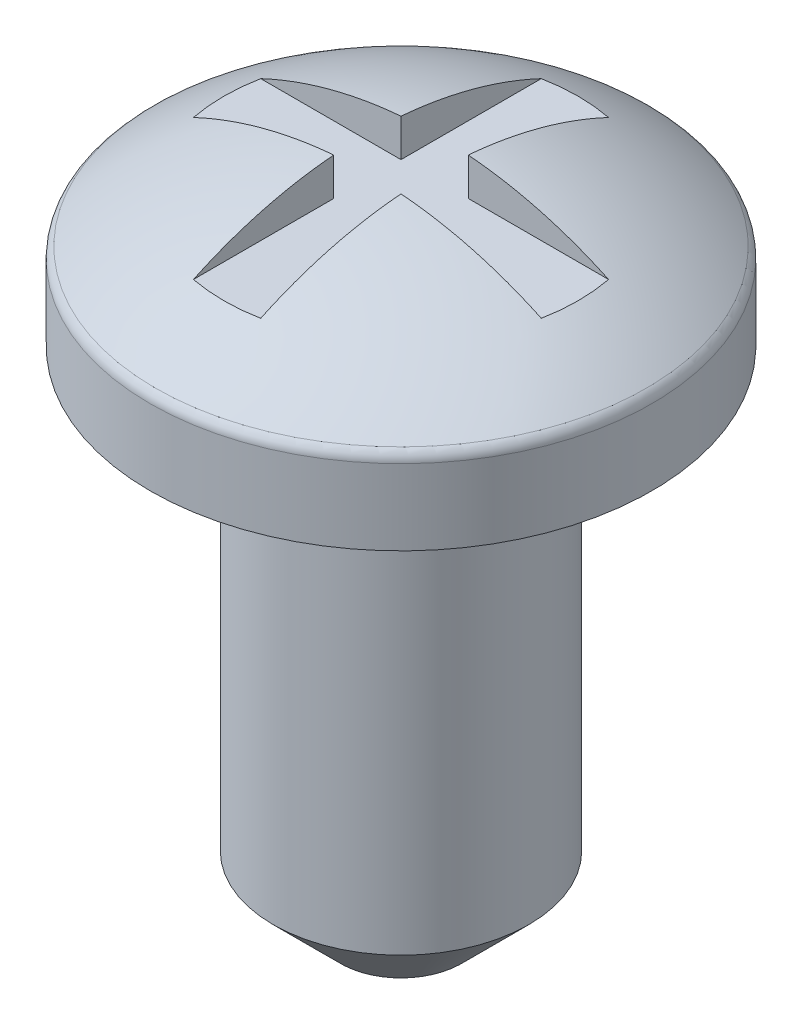
ISO-10303-21;
HEADER;
FILE_DESCRIPTION(('STEP AP214'),'2;1');
FILE_NAME('part.step','',(''),(''),'','','');
FILE_SCHEMA(('AUTOMOTIVE_DESIGN { 1 0 10303 214 1 1 1 1 }'));
ENDSEC;
DATA;
#1=APPLICATION_CONTEXT('core data for automotive mechanical design processes');
#2=APPLICATION_PROTOCOL_DEFINITION('international standard','automotive_design',2000,#1);
#3=PRODUCT_CONTEXT('',#1,'mechanical');
#4=PRODUCT('Part','Part','',(#3));
#5=PRODUCT_RELATED_PRODUCT_CATEGORY('part','',(#4));
#6=PRODUCT_DEFINITION_FORMATION('','',#4);
#7=PRODUCT_DEFINITION_CONTEXT('part definition',#1,'design');
#8=PRODUCT_DEFINITION('design','',#6,#7);
#9=PRODUCT_DEFINITION_SHAPE('','',#8);
#10=(LENGTH_UNIT() NAMED_UNIT(*) SI_UNIT(.MILLI.,.METRE.));
#11=(NAMED_UNIT(*) PLANE_ANGLE_UNIT() SI_UNIT($,.RADIAN.));
#12=(NAMED_UNIT(*) SI_UNIT($,.STERADIAN.) SOLID_ANGLE_UNIT());
#13=UNCERTAINTY_MEASURE_WITH_UNIT(LENGTH_MEASURE(1.E-05),#10,'distance_accuracy_value','');
#14=(GEOMETRIC_REPRESENTATION_CONTEXT(3) GLOBAL_UNCERTAINTY_ASSIGNED_CONTEXT((#13)) GLOBAL_UNIT_ASSIGNED_CONTEXT((#10,
#11,#12)) REPRESENTATION_CONTEXT('',''));
#15=CARTESIAN_POINT('',(0.,0.,0.));
#16=DIRECTION('',(0.,0.,1.));
#17=DIRECTION('',(1.,0.,0.));
#18=AXIS2_PLACEMENT_3D('',#15,#16,#17);
#19=CARTESIAN_POINT('',(0.,4.9784,0.));
#20=DIRECTION('',(0.,-1.,0.));
#21=DIRECTION('',(1.,0.,0.));
#22=AXIS2_PLACEMENT_3D('',#19,#20,#21);
#23=SPHERICAL_SURFACE('',#22,7.7216);
#24=CARTESIAN_POINT('',(0.,11.1537093314093,0.));
#25=DIRECTION('',(0.,-1.,0.));
#26=DIRECTION('',(0.,0.,-1.));
#27=AXIS2_PLACEMENT_3D('',#24,#25,#26);
#28=CIRCLE('',#27,4.63558639455782);
#29=CARTESIAN_POINT('',(0.,11.1537093314093,-4.63558639455782));
#30=VERTEX_POINT('',#29);
#31=EDGE_CURVE('E11',#30,#30,#28,.F.);
#32=ORIENTED_EDGE('',*,*,#31,.T.);
#33=EDGE_LOOP('',(#32));
#34=FACE_BOUND('',#33,.T.);
#35=CARTESIAN_POINT('',(0.,4.9784,0.635));
#36=DIRECTION('',(0.,0.,1.));
#37=DIRECTION('',(1.,0.,0.));
#38=AXIS2_PLACEMENT_3D('',#35,#36,#37);
#39=CIRCLE('',#38,7.69544550757135);
#40=CARTESIAN_POINT('',(0.634999999999998,12.6476018202679,0.635));
#41=VERTEX_POINT('',#40);
#42=CARTESIAN_POINT('',(3.28387719015191,11.938,0.635));
#43=VERTEX_POINT('',#42);
#44=EDGE_CURVE('E162',#41,#43,#39,.F.);
#45=ORIENTED_EDGE('',*,*,#44,.F.);
#46=CARTESIAN_POINT('',(0.635,4.9784,0.));
#47=DIRECTION('',(-1.,0.,0.));
#48=DIRECTION('',(0.,0.,1.));
#49=AXIS2_PLACEMENT_3D('',#46,#47,#48);
#50=CIRCLE('',#49,7.69544550757135);
#51=CARTESIAN_POINT('',(0.634999999999989,11.938,3.28387719015192));
#52=VERTEX_POINT('',#51);
#53=EDGE_CURVE('E47',#41,#52,#50,.F.);
#54=ORIENTED_EDGE('',*,*,#53,.T.);
#55=CARTESIAN_POINT('',(0.,11.938,0.));
#56=DIRECTION('',(0.,-1.,0.));
#57=DIRECTION('',(1.,0.,0.));
#58=AXIS2_PLACEMENT_3D('',#55,#56,#57);
#59=CIRCLE('',#58,3.34470841778473);
#60=CARTESIAN_POINT('',(-0.635000000000012,11.938,3.28387719015191));
#61=VERTEX_POINT('',#60);
#62=EDGE_CURVE('E104',#61,#52,#59,.F.);
#63=ORIENTED_EDGE('',*,*,#62,.F.);
#64=CARTESIAN_POINT('',(-0.635,4.9784,0.));
#65=DIRECTION('',(-1.,0.,0.));
#66=DIRECTION('',(0.,0.,1.));
#67=AXIS2_PLACEMENT_3D('',#64,#65,#66);
#68=CIRCLE('',#67,7.69544550757135);
#69=CARTESIAN_POINT('',(-0.635000000000002,12.6476018202679,0.634999999999996));
#70=VERTEX_POINT('',#69);
#71=EDGE_CURVE('E142',#70,#61,#68,.F.);
#72=ORIENTED_EDGE('',*,*,#71,.F.);
#73=CARTESIAN_POINT('',(0.,4.9784,0.635));
#74=DIRECTION('',(0.,0.,-1.));
#75=DIRECTION('',(-1.,0.,0.));
#76=AXIS2_PLACEMENT_3D('',#73,#74,#75);
#77=CIRCLE('',#76,7.69544550757135);
#78=CARTESIAN_POINT('',(-3.28387719015192,11.938,0.634999999999977));
#79=VERTEX_POINT('',#78);
#80=EDGE_CURVE('E133',#70,#79,#77,.F.);
#81=ORIENTED_EDGE('',*,*,#80,.T.);
#82=CARTESIAN_POINT('',(0.,11.938,0.));
#83=DIRECTION('',(0.,-1.,0.));
#84=DIRECTION('',(0.,0.,1.));
#85=AXIS2_PLACEMENT_3D('',#82,#83,#84);
#86=CIRCLE('',#85,3.34470841778473);
#87=CARTESIAN_POINT('',(-3.28387719015191,11.938,-0.635000000000023));
#88=VERTEX_POINT('',#87);
#89=EDGE_CURVE('E136',#88,#79,#86,.F.);
#90=ORIENTED_EDGE('',*,*,#89,.F.);
#91=CARTESIAN_POINT('',(0.,4.9784,-0.635));
#92=DIRECTION('',(0.,0.,-1.));
#93=DIRECTION('',(-1.,0.,0.));
#94=AXIS2_PLACEMENT_3D('',#91,#92,#93);
#95=CIRCLE('',#94,7.69544550757135);
#96=CARTESIAN_POINT('',(-0.634999999999993,12.6476018202679,-0.635000000000004));
#97=VERTEX_POINT('',#96);
#98=EDGE_CURVE('E121',#97,#88,#95,.F.);
#99=ORIENTED_EDGE('',*,*,#98,.F.);
#100=CARTESIAN_POINT('',(-0.635,4.9784,0.));
#101=DIRECTION('',(1.,0.,0.));
#102=DIRECTION('',(0.,0.,-1.));
#103=AXIS2_PLACEMENT_3D('',#100,#101,#102);
#104=CIRCLE('',#103,7.69544550757135);
#105=CARTESIAN_POINT('',(-0.634999999999966,11.938,-3.28387719015192));
#106=VERTEX_POINT('',#105);
#107=EDGE_CURVE('E120',#97,#106,#104,.F.);
#108=ORIENTED_EDGE('',*,*,#107,.T.);
#109=CARTESIAN_POINT('',(0.,11.938,0.));
#110=DIRECTION('',(0.,-1.,0.));
#111=DIRECTION('',(-1.,0.,0.));
#112=AXIS2_PLACEMENT_3D('',#109,#110,#111);
#113=CIRCLE('',#112,3.34470841778473);
#114=CARTESIAN_POINT('',(0.635000000000034,11.938,-3.28387719015191));
#115=VERTEX_POINT('',#114);
#116=EDGE_CURVE('E111',#115,#106,#113,.F.);
#117=ORIENTED_EDGE('',*,*,#116,.F.);
#118=CARTESIAN_POINT('',(0.635000000000002,12.6476018202679,-0.635));
#119=VERTEX_POINT('',#118);
#120=EDGE_CURVE('E97',#115,#119,#50,.F.);
#121=ORIENTED_EDGE('',*,*,#120,.T.);
#122=CARTESIAN_POINT('',(0.,4.9784,-0.635));
#123=DIRECTION('',(0.,0.,1.));
#124=DIRECTION('',(1.,0.,0.));
#125=AXIS2_PLACEMENT_3D('',#122,#123,#124);
#126=CIRCLE('',#125,7.69544550757135);
#127=CARTESIAN_POINT('',(3.28387719015191,11.938,-0.635));
#128=VERTEX_POINT('',#127);
#129=EDGE_CURVE('E55',#119,#128,#126,.F.);
#130=ORIENTED_EDGE('',*,*,#129,.T.);
#131=CARTESIAN_POINT('',(0.,11.938,0.));
#132=DIRECTION('',(0.,-1.,0.));
#133=DIRECTION('',(0.,0.,-1.));
#134=AXIS2_PLACEMENT_3D('',#131,#132,#133);
#135=CIRCLE('',#134,3.34470841778473);
#136=EDGE_CURVE('E165',#43,#128,#135,.F.);
#137=ORIENTED_EDGE('',*,*,#136,.F.);
#138=EDGE_LOOP('',(#45,#54,#63,#72,#81,#90,#99,#108,#117,#121,#130,#137));
#139=FACE_BOUND('',#138,.T.);
#140=ADVANCED_FACE('F32',(#34,#139),#23,.T.);
#141=CARTESIAN_POINT('',(0.,4.9784,-0.635));
#142=DIRECTION('',(0.,0.,1.));
#143=DIRECTION('',(1.,0.,0.));
#144=AXIS2_PLACEMENT_3D('',#141,#142,#143);
#145=PLANE('',#144);
#146=ORIENTED_EDGE('',*,*,#129,.F.);
#147=DIRECTION('',(0.,-1.,0.));
#148=VECTOR('',#147,1.);
#149=CARTESIAN_POINT('',(0.635000000000002,4.9784,-0.635));
#150=LINE('',#149,#148);
#151=CARTESIAN_POINT('',(0.635000000000002,11.938,-0.635));
#152=VERTEX_POINT('',#151);
#153=EDGE_CURVE('E102',#119,#152,#150,.T.);
#154=ORIENTED_EDGE('',*,*,#153,.T.);
#155=DIRECTION('',(1.,0.,0.));
#156=VECTOR('',#155,1.);
#157=CARTESIAN_POINT('',(0.,11.938,-0.635));
#158=LINE('',#157,#156);
#159=EDGE_CURVE('E114',#152,#128,#158,.T.);
#160=ORIENTED_EDGE('',*,*,#159,.T.);
#161=EDGE_LOOP('',(#146,#154,#160));
#162=FACE_BOUND('',#161,.T.);
#163=ADVANCED_FACE('F191',(#162),#145,.T.);
#164=CARTESIAN_POINT('',(0.,4.9784,0.635));
#165=DIRECTION('',(0.,0.,1.));
#166=DIRECTION('',(1.,0.,0.));
#167=AXIS2_PLACEMENT_3D('',#164,#165,#166);
#168=PLANE('',#167);
#169=DIRECTION('',(0.,-1.,0.));
#170=VECTOR('',#169,1.);
#171=CARTESIAN_POINT('',(0.634999999999998,4.9784,0.635));
#172=LINE('',#171,#170);
#173=CARTESIAN_POINT('',(0.634999999999998,11.938,0.635));
#174=VERTEX_POINT('',#173);
#175=EDGE_CURVE('E168',#41,#174,#172,.T.);
#176=ORIENTED_EDGE('',*,*,#175,.F.);
#177=ORIENTED_EDGE('',*,*,#44,.T.);
#178=DIRECTION('',(1.,0.,0.));
#179=VECTOR('',#178,1.);
#180=CARTESIAN_POINT('',(0.,11.938,0.635));
#181=LINE('',#180,#179);
#182=EDGE_CURVE('E153',#174,#43,#181,.T.);
#183=ORIENTED_EDGE('',*,*,#182,.F.);
#184=EDGE_LOOP('',(#176,#177,#183));
#185=FACE_BOUND('',#184,.T.);
#186=ADVANCED_FACE('F197',(#185),#168,.F.);
#187=CARTESIAN_POINT('',(0.,0.,0.));
#188=DIRECTION('',(0.,-1.,0.));
#189=DIRECTION('',(0.,0.,-1.));
#190=AXIS2_PLACEMENT_3D('',#187,#188,#189);
#191=CYLINDRICAL_SURFACE('',#190,4.7371);
#192=CARTESIAN_POINT('',(0.,10.950574156034,0.));
#193=DIRECTION('',(0.,-1.,0.));
#194=DIRECTION('',(0.,0.,-1.));
#195=AXIS2_PLACEMENT_3D('',#192,#193,#194);
#196=CIRCLE('',#195,4.7371);
#197=CARTESIAN_POINT('',(0.,10.950574156034,-4.7371));
#198=VERTEX_POINT('',#197);
#199=EDGE_CURVE('E40',#198,#198,#196,.T.);
#200=ORIENTED_EDGE('',*,*,#199,.T.);
#201=EDGE_LOOP('',(#200));
#202=FACE_BOUND('',#201,.T.);
#203=CARTESIAN_POINT('',(0.,9.525,0.));
#204=DIRECTION('',(0.,-1.,0.));
#205=DIRECTION('',(0.,0.,-1.));
#206=AXIS2_PLACEMENT_3D('',#203,#204,#205);
#207=CIRCLE('',#206,4.7371);
#208=CARTESIAN_POINT('',(0.,9.525,-4.7371));
#209=VERTEX_POINT('',#208);
#210=EDGE_CURVE('E159',#209,#209,#207,.T.);
#211=ORIENTED_EDGE('',*,*,#210,.F.);
#212=EDGE_LOOP('',(#211));
#213=FACE_BOUND('',#212,.T.);
#214=ADVANCED_FACE('F178',(#202,#213),#191,.T.);
#215=CARTESIAN_POINT('',(2.413,9.525,0.));
#216=DIRECTION('',(0.,-1.,0.));
#217=DIRECTION('',(0.,0.,-1.));
#218=AXIS2_PLACEMENT_3D('',#215,#216,#217);
#219=PLANE('',#218);
#220=ORIENTED_EDGE('',*,*,#210,.T.);
#221=EDGE_LOOP('',(#220));
#222=FACE_BOUND('',#221,.T.);
#223=CARTESIAN_POINT('',(0.,9.525,0.));
#224=DIRECTION('',(0.,-1.,0.));
#225=DIRECTION('',(0.,0.,-1.));
#226=AXIS2_PLACEMENT_3D('',#223,#224,#225);
#227=CIRCLE('',#226,2.413);
#228=CARTESIAN_POINT('',(0.,9.525,-2.413));
#229=VERTEX_POINT('',#228);
#230=EDGE_CURVE('E155',#229,#229,#227,.T.);
#231=ORIENTED_EDGE('',*,*,#230,.F.);
#232=EDGE_LOOP('',(#231));
#233=FACE_BOUND('',#232,.T.);
#234=ADVANCED_FACE('F203',(#222,#233),#219,.T.);
#235=CARTESIAN_POINT('',(0.,0.,0.));
#236=DIRECTION('',(0.,-1.,0.));
#237=DIRECTION('',(0.,0.,-1.));
#238=AXIS2_PLACEMENT_3D('',#235,#236,#237);
#239=CYLINDRICAL_SURFACE('',#238,2.413);
#240=CARTESIAN_POINT('',(0.,1.27,0.));
#241=DIRECTION('',(0.,-1.,0.));
#242=DIRECTION('',(0.,0.,-1.));
#243=AXIS2_PLACEMENT_3D('',#240,#241,#242);
#244=CIRCLE('',#243,2.413);
#245=CARTESIAN_POINT('',(0.,1.27,-2.413));
#246=VERTEX_POINT('',#245);
#247=EDGE_CURVE('E173',#246,#246,#244,.F.);
#248=ORIENTED_EDGE('',*,*,#247,.T.);
#249=EDGE_LOOP('',(#248));
#250=FACE_BOUND('',#249,.T.);
#251=ORIENTED_EDGE('',*,*,#230,.T.);
#252=EDGE_LOOP('',(#251));
#253=FACE_BOUND('',#252,.T.);
#254=ADVANCED_FACE('F206',(#250,#253),#239,.T.);
#255=CARTESIAN_POINT('',(0.,0.,0.));
#256=DIRECTION('',(0.,-1.,0.));
#257=DIRECTION('',(0.,0.,-1.));
#258=AXIS2_PLACEMENT_3D('',#255,#256,#257);
#259=PLANE('',#258);
#260=CARTESIAN_POINT('',(0.,0.,0.));
#261=DIRECTION('',(0.,-1.,0.));
#262=DIRECTION('',(0.,0.,-1.));
#263=AXIS2_PLACEMENT_3D('',#260,#261,#262);
#264=CIRCLE('',#263,1.143);
#265=CARTESIAN_POINT('',(0.,0.,-1.143));
#266=VERTEX_POINT('',#265);
#267=EDGE_CURVE('E170',#266,#266,#264,.T.);
#268=ORIENTED_EDGE('',*,*,#267,.T.);
#269=EDGE_LOOP('',(#268));
#270=FACE_BOUND('',#269,.T.);
#271=ADVANCED_FACE('F210',(#270),#259,.T.);
#272=CARTESIAN_POINT('',(0.,11.938,-0.635));
#273=DIRECTION('',(0.,-1.,0.));
#274=DIRECTION('',(0.,0.,-1.));
#275=AXIS2_PLACEMENT_3D('',#272,#273,#274);
#276=PLANE('',#275);
#277=DIRECTION('',(0.,0.,1.));
#278=VECTOR('',#277,1.);
#279=CARTESIAN_POINT('',(0.635,11.938,0.));
#280=LINE('',#279,#278);
#281=EDGE_CURVE('E115',#174,#52,#280,.T.);
#282=ORIENTED_EDGE('',*,*,#281,.F.);
#283=ORIENTED_EDGE('',*,*,#182,.T.);
#284=ORIENTED_EDGE('',*,*,#136,.T.);
#285=ORIENTED_EDGE('',*,*,#159,.F.);
#286=EDGE_CURVE('E100',#115,#152,#280,.T.);
#287=ORIENTED_EDGE('',*,*,#286,.F.);
#288=ORIENTED_EDGE('',*,*,#116,.T.);
#289=DIRECTION('',(0.,0.,-1.));
#290=VECTOR('',#289,1.);
#291=CARTESIAN_POINT('',(-0.635,11.938,0.));
#292=LINE('',#291,#290);
#293=CARTESIAN_POINT('',(-0.634999999999993,11.938,-0.635000000000004));
#294=VERTEX_POINT('',#293);
#295=EDGE_CURVE('E126',#294,#106,#292,.T.);
#296=ORIENTED_EDGE('',*,*,#295,.F.);
#297=DIRECTION('',(-1.,0.,0.));
#298=VECTOR('',#297,1.);
#299=CARTESIAN_POINT('',(0.,11.938,-0.635));
#300=LINE('',#299,#298);
#301=EDGE_CURVE('E124',#294,#88,#300,.T.);
#302=ORIENTED_EDGE('',*,*,#301,.T.);
#303=ORIENTED_EDGE('',*,*,#89,.T.);
#304=DIRECTION('',(-1.,0.,0.));
#305=VECTOR('',#304,1.);
#306=CARTESIAN_POINT('',(0.,11.938,0.635));
#307=LINE('',#306,#305);
#308=CARTESIAN_POINT('',(-0.635000000000002,11.938,0.634999999999996));
#309=VERTEX_POINT('',#308);
#310=EDGE_CURVE('E131',#309,#79,#307,.T.);
#311=ORIENTED_EDGE('',*,*,#310,.F.);
#312=DIRECTION('',(0.,0.,1.));
#313=VECTOR('',#312,1.);
#314=CARTESIAN_POINT('',(-0.635,11.938,0.));
#315=LINE('',#314,#313);
#316=EDGE_CURVE('E145',#309,#61,#315,.T.);
#317=ORIENTED_EDGE('',*,*,#316,.T.);
#318=ORIENTED_EDGE('',*,*,#62,.T.);
#319=EDGE_LOOP('',(#282,#283,#284,#285,#287,#288,#296,#302,#303,#311,#317,#318));
#320=FACE_BOUND('',#319,.T.);
#321=ADVANCED_FACE('F110',(#320),#276,.F.);
#322=CARTESIAN_POINT('',(0.635,4.9784,0.));
#323=DIRECTION('',(-1.,0.,0.));
#324=DIRECTION('',(0.,0.,1.));
#325=AXIS2_PLACEMENT_3D('',#322,#323,#324);
#326=PLANE('',#325);
#327=ORIENTED_EDGE('',*,*,#175,.T.);
#328=ORIENTED_EDGE('',*,*,#281,.T.);
#329=ORIENTED_EDGE('',*,*,#53,.F.);
#330=EDGE_LOOP('',(#327,#328,#329));
#331=FACE_BOUND('',#330,.T.);
#332=ADVANCED_FACE('F217',(#331),#326,.T.);
#333=CARTESIAN_POINT('',(-0.635,4.9784,0.));
#334=DIRECTION('',(-1.,0.,0.));
#335=DIRECTION('',(0.,0.,1.));
#336=AXIS2_PLACEMENT_3D('',#333,#334,#335);
#337=PLANE('',#336);
#338=ORIENTED_EDGE('',*,*,#71,.T.);
#339=ORIENTED_EDGE('',*,*,#316,.F.);
#340=DIRECTION('',(0.,-1.,0.));
#341=VECTOR('',#340,1.);
#342=CARTESIAN_POINT('',(-0.635000000000002,4.9784,0.634999999999996));
#343=LINE('',#342,#341);
#344=EDGE_CURVE('E149',#70,#309,#343,.T.);
#345=ORIENTED_EDGE('',*,*,#344,.F.);
#346=EDGE_LOOP('',(#338,#339,#345));
#347=FACE_BOUND('',#346,.T.);
#348=ADVANCED_FACE('F224',(#347),#337,.F.);
#349=ORIENTED_EDGE('',*,*,#120,.F.);
#350=ORIENTED_EDGE('',*,*,#286,.T.);
#351=ORIENTED_EDGE('',*,*,#153,.F.);
#352=EDGE_LOOP('',(#349,#350,#351));
#353=FACE_BOUND('',#352,.T.);
#354=ADVANCED_FACE('F99',(#353),#326,.T.);
#355=CARTESIAN_POINT('',(0.,4.9784,-0.635));
#356=DIRECTION('',(0.,0.,-1.));
#357=DIRECTION('',(-1.,0.,0.));
#358=AXIS2_PLACEMENT_3D('',#355,#356,#357);
#359=PLANE('',#358);
#360=ORIENTED_EDGE('',*,*,#98,.T.);
#361=ORIENTED_EDGE('',*,*,#301,.F.);
#362=DIRECTION('',(0.,-1.,0.));
#363=VECTOR('',#362,1.);
#364=CARTESIAN_POINT('',(-0.634999999999993,4.9784,-0.635000000000004));
#365=LINE('',#364,#363);
#366=EDGE_CURVE('E139',#97,#294,#365,.T.);
#367=ORIENTED_EDGE('',*,*,#366,.F.);
#368=EDGE_LOOP('',(#360,#361,#367));
#369=FACE_BOUND('',#368,.T.);
#370=ADVANCED_FACE('F223',(#369),#359,.F.);
#371=CARTESIAN_POINT('',(0.,4.9784,0.635));
#372=DIRECTION('',(0.,0.,-1.));
#373=DIRECTION('',(-1.,0.,0.));
#374=AXIS2_PLACEMENT_3D('',#371,#372,#373);
#375=PLANE('',#374);
#376=ORIENTED_EDGE('',*,*,#344,.T.);
#377=ORIENTED_EDGE('',*,*,#310,.T.);
#378=ORIENTED_EDGE('',*,*,#80,.F.);
#379=EDGE_LOOP('',(#376,#377,#378));
#380=FACE_BOUND('',#379,.T.);
#381=ADVANCED_FACE('F228',(#380),#375,.T.);
#382=CARTESIAN_POINT('',(-0.635,4.9784,0.));
#383=DIRECTION('',(1.,0.,0.));
#384=DIRECTION('',(0.,0.,-1.));
#385=AXIS2_PLACEMENT_3D('',#382,#383,#384);
#386=PLANE('',#385);
#387=ORIENTED_EDGE('',*,*,#366,.T.);
#388=ORIENTED_EDGE('',*,*,#295,.T.);
#389=ORIENTED_EDGE('',*,*,#107,.F.);
#390=EDGE_LOOP('',(#387,#388,#389));
#391=FACE_BOUND('',#390,.T.);
#392=ADVANCED_FACE('F187',(#391),#386,.T.);
#393=CARTESIAN_POINT('',(0.,0.,0.));
#394=DIRECTION('',(0.,1.,0.));
#395=DIRECTION('',(0.,0.,1.));
#396=AXIS2_PLACEMENT_3D('',#393,#394,#395);
#397=CONICAL_SURFACE('',#396,1.143,0.785398163397447);
#398=ORIENTED_EDGE('',*,*,#247,.F.);
#399=EDGE_LOOP('',(#398));
#400=FACE_BOUND('',#399,.T.);
#401=ORIENTED_EDGE('',*,*,#267,.F.);
#402=EDGE_LOOP('',(#401));
#403=FACE_BOUND('',#402,.T.);
#404=ADVANCED_FACE('F182',(#400,#403),#397,.T.);
#405=CARTESIAN_POINT('',(0.,10.950574156034,0.));
#406=DIRECTION('',(0.,-1.,0.));
#407=DIRECTION('',(0.,0.,-1.));
#408=AXIS2_PLACEMENT_3D('',#405,#406,#407);
#409=TOROIDAL_SURFACE('',#408,4.4831,0.254);
#410=ORIENTED_EDGE('',*,*,#31,.F.);
#411=EDGE_LOOP('',(#410));
#412=FACE_BOUND('',#411,.T.);
#413=ORIENTED_EDGE('',*,*,#199,.F.);
#414=EDGE_LOOP('',(#413));
#415=FACE_BOUND('',#414,.T.);
#416=ADVANCED_FACE('F34',(#412,#415),#409,.T.);
#417=CLOSED_SHELL('',(#140,#163,#186,#214,#234,#254,#271,#321,#332,#348,#354,#370,#381,#392,
#404,#416));
#418=MANIFOLD_SOLID_BREP('B2',#417);
#419=ADVANCED_BREP_SHAPE_REPRESENTATION('',(#18,#418),#14);
#420=SHAPE_DEFINITION_REPRESENTATION(#9,#419);
ENDSEC;
END-ISO-10303-21;
